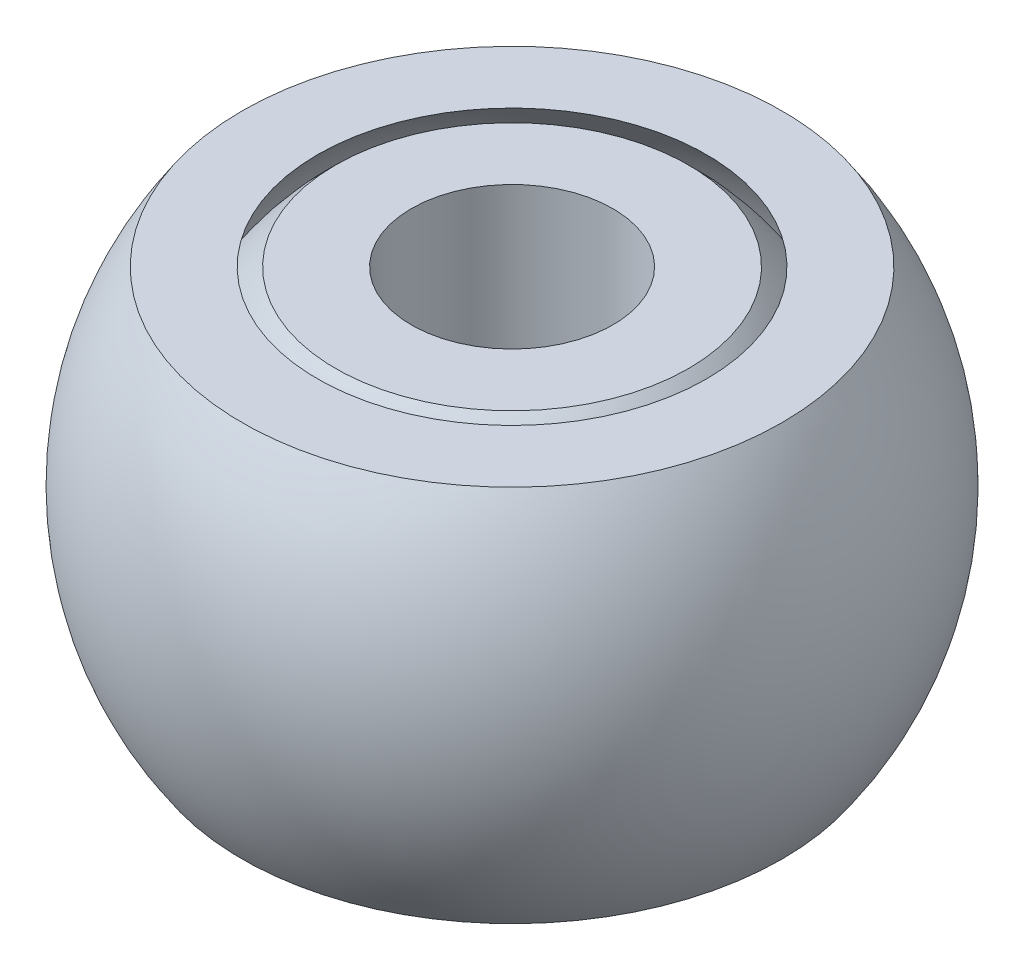
ISO-10303-21;
HEADER;
FILE_DESCRIPTION(('STEP AP214'),'2;1');
FILE_NAME('part.step','',(''),(''),'','','');
FILE_SCHEMA(('AUTOMOTIVE_DESIGN { 1 0 10303 214 1 1 1 1 }'));
ENDSEC;
DATA;
#1=APPLICATION_CONTEXT('core data for automotive mechanical design processes');
#2=APPLICATION_PROTOCOL_DEFINITION('international standard','automotive_design',2000,#1);
#3=PRODUCT_CONTEXT('',#1,'mechanical');
#4=PRODUCT('Part','Part','',(#3));
#5=PRODUCT_RELATED_PRODUCT_CATEGORY('part','',(#4));
#6=PRODUCT_DEFINITION_FORMATION('','',#4);
#7=PRODUCT_DEFINITION_CONTEXT('part definition',#1,'design');
#8=PRODUCT_DEFINITION('design','',#6,#7);
#9=PRODUCT_DEFINITION_SHAPE('','',#8);
#10=(LENGTH_UNIT() NAMED_UNIT(*) SI_UNIT(.MILLI.,.METRE.));
#11=(NAMED_UNIT(*) PLANE_ANGLE_UNIT() SI_UNIT($,.RADIAN.));
#12=(NAMED_UNIT(*) SI_UNIT($,.STERADIAN.) SOLID_ANGLE_UNIT());
#13=UNCERTAINTY_MEASURE_WITH_UNIT(LENGTH_MEASURE(1.E-05),#10,'distance_accuracy_value','');
#14=(GEOMETRIC_REPRESENTATION_CONTEXT(3) GLOBAL_UNCERTAINTY_ASSIGNED_CONTEXT((#13)) GLOBAL_UNIT_ASSIGNED_CONTEXT((#10,
#11,#12)) REPRESENTATION_CONTEXT('',''));
#15=CARTESIAN_POINT('',(0.,0.,0.));
#16=DIRECTION('',(0.,0.,1.));
#17=DIRECTION('',(1.,0.,0.));
#18=AXIS2_PLACEMENT_3D('',#15,#16,#17);
#19=CARTESIAN_POINT('',(0.,0.,0.));
#20=DIRECTION('',(0.,1.,0.));
#21=DIRECTION('',(-1.,0.,0.));
#22=AXIS2_PLACEMENT_3D('',#19,#20,#21);
#23=SPHERICAL_SURFACE('',#22,13.0783960644747);
#24=CARTESIAN_POINT('',(0.,-7.49999999999999,0.));
#25=DIRECTION('',(0.,1.,0.));
#26=DIRECTION('',(-1.,0.,0.));
#27=AXIS2_PLACEMENT_3D('',#24,#25,#26);
#28=CIRCLE('',#27,10.7142168924876);
#29=CARTESIAN_POINT('',(-10.7142168924876,-7.5,0.));
#30=VERTEX_POINT('',#29);
#31=EDGE_CURVE('E100',#30,#30,#28,.T.);
#32=ORIENTED_EDGE('',*,*,#31,.T.);
#33=EDGE_LOOP('',(#32));
#34=FACE_BOUND('',#33,.T.);
#35=CARTESIAN_POINT('',(0.,7.5,0.));
#36=DIRECTION('',(0.,1.,0.));
#37=DIRECTION('',(-1.,0.,0.));
#38=AXIS2_PLACEMENT_3D('',#35,#36,#37);
#39=CIRCLE('',#38,10.7142168924876);
#40=CARTESIAN_POINT('',(-10.7142168924876,7.5,0.));
#41=VERTEX_POINT('',#40);
#42=EDGE_CURVE('E108',#41,#41,#39,.T.);
#43=ORIENTED_EDGE('',*,*,#42,.F.);
#44=EDGE_LOOP('',(#43));
#45=FACE_BOUND('',#44,.T.);
#46=CARTESIAN_POINT('',(0.,-3.5,0.));
#47=DIRECTION('',(0.,1.,0.));
#48=DIRECTION('',(0.,0.,1.));
#49=AXIS2_PLACEMENT_3D('',#46,#47,#48);
#50=CIRCLE('',#49,12.6013667361627);
#51=CARTESIAN_POINT('',(-12.1055542466781,-3.5,3.5));
#52=VERTEX_POINT('',#51);
#53=CARTESIAN_POINT('',(-12.1055542466781,-3.5,-3.5));
#54=VERTEX_POINT('',#53);
#55=EDGE_CURVE('E114',#52,#54,#50,.F.);
#56=ORIENTED_EDGE('',*,*,#55,.T.);
#57=CARTESIAN_POINT('',(0.,0.,-3.5));
#58=DIRECTION('',(0.,0.,1.));
#59=DIRECTION('',(0.,-1.,0.));
#60=AXIS2_PLACEMENT_3D('',#57,#58,#59);
#61=CIRCLE('',#60,12.6013667361627);
#62=CARTESIAN_POINT('',(-12.1055542466781,3.5,-3.5));
#63=VERTEX_POINT('',#62);
#64=EDGE_CURVE('E12',#54,#63,#61,.F.);
#65=ORIENTED_EDGE('',*,*,#64,.T.);
#66=CARTESIAN_POINT('',(0.,3.5,0.));
#67=DIRECTION('',(0.,-1.,0.));
#68=DIRECTION('',(0.,0.,-1.));
#69=AXIS2_PLACEMENT_3D('',#66,#67,#68);
#70=CIRCLE('',#69,12.6013667361627);
#71=CARTESIAN_POINT('',(-12.1055542466781,3.5,3.5));
#72=VERTEX_POINT('',#71);
#73=EDGE_CURVE('E49',#63,#72,#70,.F.);
#74=ORIENTED_EDGE('',*,*,#73,.T.);
#75=CARTESIAN_POINT('',(0.,0.,3.5));
#76=DIRECTION('',(0.,0.,-1.));
#77=DIRECTION('',(-1.,0.,0.));
#78=AXIS2_PLACEMENT_3D('',#75,#76,#77);
#79=CIRCLE('',#78,12.6013667361627);
#80=EDGE_CURVE('E117',#72,#52,#79,.F.);
#81=ORIENTED_EDGE('',*,*,#80,.T.);
#82=EDGE_LOOP('',(#56,#65,#74,#81));
#83=FACE_BOUND('',#82,.T.);
#84=ADVANCED_FACE('F41',(#34,#45,#83),#23,.T.);
#85=CARTESIAN_POINT('',(0.,0.,0.));
#86=DIRECTION('',(0.,1.,0.));
#87=DIRECTION('',(-1.,0.,0.));
#88=AXIS2_PLACEMENT_3D('',#85,#86,#87);
#89=SPHERICAL_SURFACE('',#88,10.7591422643416);
#90=CARTESIAN_POINT('',(0.,7.5,0.));
#91=DIRECTION('',(0.,1.,0.));
#92=DIRECTION('',(-1.,0.,0.));
#93=AXIS2_PLACEMENT_3D('',#90,#91,#92);
#94=CIRCLE('',#93,7.71421689248763);
#95=CARTESIAN_POINT('',(-7.71421689248764,7.5,0.));
#96=VERTEX_POINT('',#95);
#97=EDGE_CURVE('E111',#96,#96,#94,.T.);
#98=ORIENTED_EDGE('',*,*,#97,.T.);
#99=EDGE_LOOP('',(#98));
#100=FACE_BOUND('',#99,.T.);
#101=CARTESIAN_POINT('',(0.,-7.5,0.));
#102=DIRECTION('',(0.,1.,0.));
#103=DIRECTION('',(-1.,0.,0.));
#104=AXIS2_PLACEMENT_3D('',#101,#102,#103);
#105=CIRCLE('',#104,7.71421689248764);
#106=CARTESIAN_POINT('',(-7.71421689248763,-7.5,0.));
#107=VERTEX_POINT('',#106);
#108=EDGE_CURVE('E96',#107,#107,#105,.T.);
#109=ORIENTED_EDGE('',*,*,#108,.F.);
#110=EDGE_LOOP('',(#109));
#111=FACE_BOUND('',#110,.T.);
#112=ADVANCED_FACE('F43',(#100,#111),#89,.F.);
#113=CARTESIAN_POINT('',(-7.71421689248764,7.5,0.));
#114=DIRECTION('',(0.,1.,0.));
#115=DIRECTION('',(-1.,0.,0.));
#116=AXIS2_PLACEMENT_3D('',#113,#114,#115);
#117=PLANE('',#116);
#118=ORIENTED_EDGE('',*,*,#42,.T.);
#119=EDGE_LOOP('',(#118));
#120=FACE_BOUND('',#119,.T.);
#121=ORIENTED_EDGE('',*,*,#97,.F.);
#122=EDGE_LOOP('',(#121));
#123=FACE_BOUND('',#122,.T.);
#124=ADVANCED_FACE('F143',(#120,#123),#117,.T.);
#125=CARTESIAN_POINT('',(-7.71421689248763,-7.5,0.));
#126=DIRECTION('',(0.,-1.,0.));
#127=DIRECTION('',(1.,0.,0.));
#128=AXIS2_PLACEMENT_3D('',#125,#126,#127);
#129=PLANE('',#128);
#130=ORIENTED_EDGE('',*,*,#108,.T.);
#131=EDGE_LOOP('',(#130));
#132=FACE_BOUND('',#131,.T.);
#133=ORIENTED_EDGE('',*,*,#31,.F.);
#134=EDGE_LOOP('',(#133));
#135=FACE_BOUND('',#134,.T.);
#136=ADVANCED_FACE('F147',(#132,#135),#129,.T.);
#137=CARTESIAN_POINT('',(-12.0783960644747,3.5,-3.5));
#138=DIRECTION('',(0.,0.,1.));
#139=DIRECTION('',(0.,-1.,0.));
#140=AXIS2_PLACEMENT_3D('',#137,#138,#139);
#141=PLANE('',#140);
#142=DIRECTION('',(-1.,0.,0.));
#143=VECTOR('',#142,1.);
#144=CARTESIAN_POINT('',(-12.0783960644747,-3.5,-3.5));
#145=LINE('',#144,#143);
#146=CARTESIAN_POINT('',(-12.0783960644747,-3.5,-3.5));
#147=VERTEX_POINT('',#146);
#148=EDGE_CURVE('E56',#147,#54,#145,.T.);
#149=ORIENTED_EDGE('',*,*,#148,.F.);
#150=DIRECTION('',(0.,1.,0.));
#151=VECTOR('',#150,1.);
#152=CARTESIAN_POINT('',(-12.0783960644747,3.5,-3.5));
#153=LINE('',#152,#151);
#154=CARTESIAN_POINT('',(-12.0783960644747,3.5,-3.5));
#155=VERTEX_POINT('',#154);
#156=EDGE_CURVE('E87',#147,#155,#153,.T.);
#157=ORIENTED_EDGE('',*,*,#156,.T.);
#158=DIRECTION('',(-1.,0.,0.));
#159=VECTOR('',#158,1.);
#160=CARTESIAN_POINT('',(-12.0783960644747,3.5,-3.5));
#161=LINE('',#160,#159);
#162=EDGE_CURVE('E93',#155,#63,#161,.T.);
#163=ORIENTED_EDGE('',*,*,#162,.T.);
#164=ORIENTED_EDGE('',*,*,#64,.F.);
#165=EDGE_LOOP('',(#149,#157,#163,#164));
#166=FACE_BOUND('',#165,.T.);
#167=ADVANCED_FACE('F92',(#166),#141,.T.);
#168=CARTESIAN_POINT('',(-12.0783960644747,3.5,-3.5));
#169=DIRECTION('',(0.,-1.,0.));
#170=DIRECTION('',(0.,0.,-1.));
#171=AXIS2_PLACEMENT_3D('',#168,#169,#170);
#172=PLANE('',#171);
#173=ORIENTED_EDGE('',*,*,#162,.F.);
#174=DIRECTION('',(0.,0.,1.));
#175=VECTOR('',#174,1.);
#176=CARTESIAN_POINT('',(-12.0783960644747,3.5,-3.5));
#177=LINE('',#176,#175);
#178=CARTESIAN_POINT('',(-12.0783960644747,3.5,3.5));
#179=VERTEX_POINT('',#178);
#180=EDGE_CURVE('E83',#155,#179,#177,.T.);
#181=ORIENTED_EDGE('',*,*,#180,.T.);
#182=DIRECTION('',(-1.,0.,0.));
#183=VECTOR('',#182,1.);
#184=CARTESIAN_POINT('',(-12.0783960644747,3.5,3.5));
#185=LINE('',#184,#183);
#186=EDGE_CURVE('E97',#179,#72,#185,.T.);
#187=ORIENTED_EDGE('',*,*,#186,.T.);
#188=ORIENTED_EDGE('',*,*,#73,.F.);
#189=EDGE_LOOP('',(#173,#181,#187,#188));
#190=FACE_BOUND('',#189,.T.);
#191=ADVANCED_FACE('F95',(#190),#172,.T.);
#192=CARTESIAN_POINT('',(-12.0783960644747,3.5,3.5));
#193=DIRECTION('',(0.,0.,-1.));
#194=DIRECTION('',(-1.,0.,0.));
#195=AXIS2_PLACEMENT_3D('',#192,#193,#194);
#196=PLANE('',#195);
#197=ORIENTED_EDGE('',*,*,#186,.F.);
#198=DIRECTION('',(0.,-1.,0.));
#199=VECTOR('',#198,1.);
#200=CARTESIAN_POINT('',(-12.0783960644747,3.5,3.5));
#201=LINE('',#200,#199);
#202=CARTESIAN_POINT('',(-12.0783960644747,-3.5,3.5));
#203=VERTEX_POINT('',#202);
#204=EDGE_CURVE('E88',#179,#203,#201,.T.);
#205=ORIENTED_EDGE('',*,*,#204,.T.);
#206=DIRECTION('',(-1.,0.,0.));
#207=VECTOR('',#206,1.);
#208=CARTESIAN_POINT('',(-12.0783960644747,-3.5,3.5));
#209=LINE('',#208,#207);
#210=EDGE_CURVE('E102',#203,#52,#209,.T.);
#211=ORIENTED_EDGE('',*,*,#210,.T.);
#212=ORIENTED_EDGE('',*,*,#80,.F.);
#213=EDGE_LOOP('',(#197,#205,#211,#212));
#214=FACE_BOUND('',#213,.T.);
#215=ADVANCED_FACE('F124',(#214),#196,.T.);
#216=CARTESIAN_POINT('',(-12.0783960644747,-3.5,-3.5));
#217=DIRECTION('',(0.,1.,0.));
#218=DIRECTION('',(0.,0.,1.));
#219=AXIS2_PLACEMENT_3D('',#216,#217,#218);
#220=PLANE('',#219);
#221=ORIENTED_EDGE('',*,*,#210,.F.);
#222=DIRECTION('',(0.,0.,-1.));
#223=VECTOR('',#222,1.);
#224=CARTESIAN_POINT('',(-12.0783960644747,-3.5,-3.5));
#225=LINE('',#224,#223);
#226=EDGE_CURVE('E125',#203,#147,#225,.T.);
#227=ORIENTED_EDGE('',*,*,#226,.T.);
#228=ORIENTED_EDGE('',*,*,#148,.T.);
#229=ORIENTED_EDGE('',*,*,#55,.F.);
#230=EDGE_LOOP('',(#221,#227,#228,#229));
#231=FACE_BOUND('',#230,.T.);
#232=ADVANCED_FACE('F122',(#231),#220,.T.);
#233=CARTESIAN_POINT('',(-12.0783960644747,0.,0.));
#234=DIRECTION('',(-1.,0.,0.));
#235=DIRECTION('',(0.,0.,1.));
#236=AXIS2_PLACEMENT_3D('',#233,#234,#235);
#237=PLANE('',#236);
#238=ORIENTED_EDGE('',*,*,#156,.F.);
#239=ORIENTED_EDGE('',*,*,#226,.F.);
#240=ORIENTED_EDGE('',*,*,#204,.F.);
#241=ORIENTED_EDGE('',*,*,#180,.F.);
#242=EDGE_LOOP('',(#238,#239,#240,#241));
#243=FACE_BOUND('',#242,.T.);
#244=ADVANCED_FACE('F85',(#243),#237,.T.);
#245=CLOSED_SHELL('',(#84,#112,#124,#136,#167,#191,#215,#232,#244));
#246=MANIFOLD_SOLID_BREP('B2',#245);
#247=CARTESIAN_POINT('',(0.,0.,0.));
#248=DIRECTION('',(0.,1.,0.));
#249=DIRECTION('',(-1.,0.,0.));
#250=AXIS2_PLACEMENT_3D('',#247,#248,#249);
#251=SPHERICAL_SURFACE('',#250,10.2591422643416);
#252=CARTESIAN_POINT('',(0.,-7.5,0.));
#253=DIRECTION('',(0.,1.,0.));
#254=DIRECTION('',(-1.,0.,0.));
#255=AXIS2_PLACEMENT_3D('',#252,#253,#254);
#256=CIRCLE('',#255,7.);
#257=CARTESIAN_POINT('',(-7.,-7.5,0.));
#258=VERTEX_POINT('',#257);
#259=EDGE_CURVE('E40',#258,#258,#256,.T.);
#260=ORIENTED_EDGE('',*,*,#259,.T.);
#261=EDGE_LOOP('',(#260));
#262=FACE_BOUND('',#261,.T.);
#263=CARTESIAN_POINT('',(0.,7.5,0.));
#264=DIRECTION('',(0.,1.,0.));
#265=DIRECTION('',(-1.,0.,0.));
#266=AXIS2_PLACEMENT_3D('',#263,#264,#265);
#267=CIRCLE('',#266,7.);
#268=CARTESIAN_POINT('',(-7.,7.5,0.));
#269=VERTEX_POINT('',#268);
#270=EDGE_CURVE('E230',#269,#269,#267,.T.);
#271=ORIENTED_EDGE('',*,*,#270,.F.);
#272=EDGE_LOOP('',(#271));
#273=FACE_BOUND('',#272,.T.);
#274=ADVANCED_FACE('F216',(#262,#273),#251,.T.);
#275=CARTESIAN_POINT('',(-7.,-7.5,0.));
#276=DIRECTION('',(0.,-1.,0.));
#277=DIRECTION('',(1.,0.,0.));
#278=AXIS2_PLACEMENT_3D('',#275,#276,#277);
#279=PLANE('',#278);
#280=CARTESIAN_POINT('',(0.,-7.5,0.));
#281=DIRECTION('',(0.,1.,0.));
#282=DIRECTION('',(-1.,0.,0.));
#283=AXIS2_PLACEMENT_3D('',#280,#281,#282);
#284=CIRCLE('',#283,4.);
#285=CARTESIAN_POINT('',(-4.,-7.5,0.));
#286=VERTEX_POINT('',#285);
#287=EDGE_CURVE('E222',#286,#286,#284,.T.);
#288=ORIENTED_EDGE('',*,*,#287,.T.);
#289=EDGE_LOOP('',(#288));
#290=FACE_BOUND('',#289,.T.);
#291=ORIENTED_EDGE('',*,*,#259,.F.);
#292=EDGE_LOOP('',(#291));
#293=FACE_BOUND('',#292,.T.);
#294=ADVANCED_FACE('F240',(#290,#293),#279,.T.);
#295=CARTESIAN_POINT('',(0.,7.5,0.));
#296=DIRECTION('',(0.,1.,0.));
#297=DIRECTION('',(-1.,0.,0.));
#298=AXIS2_PLACEMENT_3D('',#295,#296,#297);
#299=CYLINDRICAL_SURFACE('',#298,4.);
#300=CARTESIAN_POINT('',(0.,7.5,0.));
#301=DIRECTION('',(0.,1.,0.));
#302=DIRECTION('',(-1.,0.,0.));
#303=AXIS2_PLACEMENT_3D('',#300,#301,#302);
#304=CIRCLE('',#303,4.);
#305=CARTESIAN_POINT('',(-4.,7.5,0.));
#306=VERTEX_POINT('',#305);
#307=EDGE_CURVE('E226',#306,#306,#304,.T.);
#308=ORIENTED_EDGE('',*,*,#307,.T.);
#309=EDGE_LOOP('',(#308));
#310=FACE_BOUND('',#309,.T.);
#311=ORIENTED_EDGE('',*,*,#287,.F.);
#312=EDGE_LOOP('',(#311));
#313=FACE_BOUND('',#312,.T.);
#314=ADVANCED_FACE('F244',(#310,#313),#299,.F.);
#315=CARTESIAN_POINT('',(-7.,7.5,0.));
#316=DIRECTION('',(0.,1.,0.));
#317=DIRECTION('',(-1.,0.,0.));
#318=AXIS2_PLACEMENT_3D('',#315,#316,#317);
#319=PLANE('',#318);
#320=ORIENTED_EDGE('',*,*,#270,.T.);
#321=EDGE_LOOP('',(#320));
#322=FACE_BOUND('',#321,.T.);
#323=ORIENTED_EDGE('',*,*,#307,.F.);
#324=EDGE_LOOP('',(#323));
#325=FACE_BOUND('',#324,.T.);
#326=ADVANCED_FACE('F236',(#322,#325),#319,.T.);
#327=CLOSED_SHELL('',(#274,#294,#314,#326));
#328=MANIFOLD_SOLID_BREP('B6',#327);
#329=ADVANCED_BREP_SHAPE_REPRESENTATION('',(#18,#246,#328),#14);
#330=SHAPE_DEFINITION_REPRESENTATION(#9,#329);
ENDSEC;
END-ISO-10303-21;
